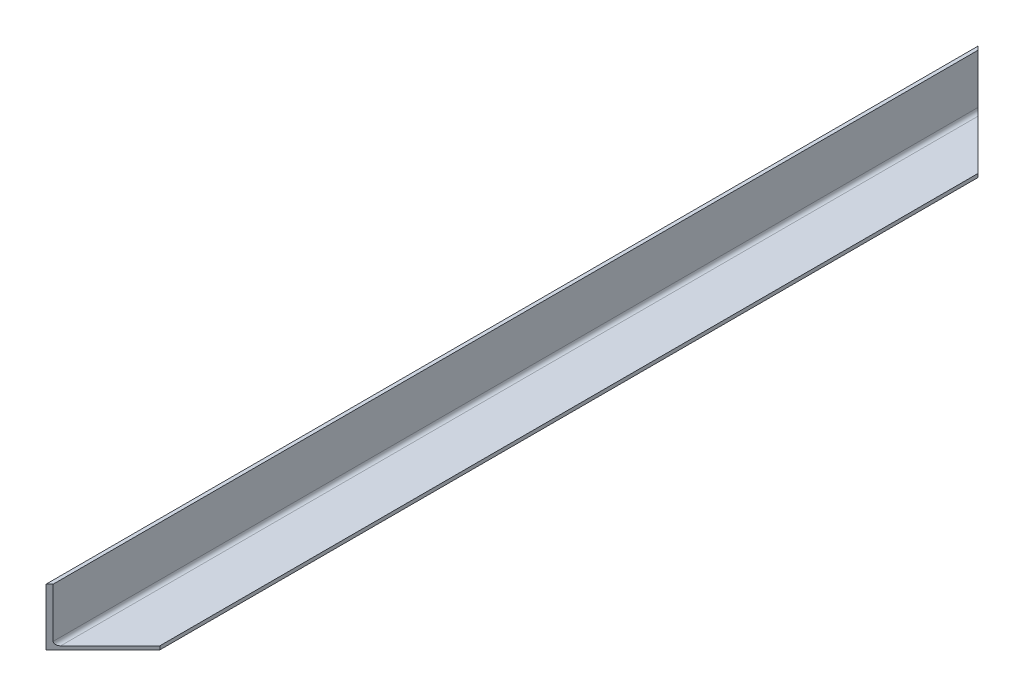
ISO-10303-21;
HEADER;
FILE_DESCRIPTION(('STEP AP214'),'2;1');
FILE_NAME('part.step','',(''),(''),'','','');
FILE_SCHEMA(('AUTOMOTIVE_DESIGN { 1 0 10303 214 1 1 1 1 }'));
ENDSEC;
DATA;
#1=APPLICATION_CONTEXT('core data for automotive mechanical design processes');
#2=APPLICATION_PROTOCOL_DEFINITION('international standard','automotive_design',2000,#1);
#3=PRODUCT_CONTEXT('',#1,'mechanical');
#4=PRODUCT('Part','Part','',(#3));
#5=PRODUCT_RELATED_PRODUCT_CATEGORY('part','',(#4));
#6=PRODUCT_DEFINITION_FORMATION('','',#4);
#7=PRODUCT_DEFINITION_CONTEXT('part definition',#1,'design');
#8=PRODUCT_DEFINITION('design','',#6,#7);
#9=PRODUCT_DEFINITION_SHAPE('','',#8);
#10=(LENGTH_UNIT() NAMED_UNIT(*) SI_UNIT(.MILLI.,.METRE.));
#11=(NAMED_UNIT(*) PLANE_ANGLE_UNIT() SI_UNIT($,.RADIAN.));
#12=(NAMED_UNIT(*) SI_UNIT($,.STERADIAN.) SOLID_ANGLE_UNIT());
#13=UNCERTAINTY_MEASURE_WITH_UNIT(LENGTH_MEASURE(1.E-05),#10,'distance_accuracy_value','');
#14=(GEOMETRIC_REPRESENTATION_CONTEXT(3) GLOBAL_UNCERTAINTY_ASSIGNED_CONTEXT((#13)) GLOBAL_UNIT_ASSIGNED_CONTEXT((#10,
#11,#12)) REPRESENTATION_CONTEXT('',''));
#15=CARTESIAN_POINT('',(0.,0.,0.));
#16=DIRECTION('',(0.,0.,1.));
#17=DIRECTION('',(1.,0.,0.));
#18=AXIS2_PLACEMENT_3D('',#15,#16,#17);
#19=CARTESIAN_POINT('',(-22.225,25.4,-415.925));
#20=DIRECTION('',(0.,1.,0.));
#21=DIRECTION('',(-1.,0.,0.));
#22=AXIS2_PLACEMENT_3D('',#19,#20,#21);
#23=PLANE('',#22);
#24=DIRECTION('',(0.707106781186547,0.,0.707106781186548));
#25=VECTOR('',#24,1.);
#26=CARTESIAN_POINT('',(-25.4,25.4,-415.925));
#27=LINE('',#26,#25);
#28=CARTESIAN_POINT('',(-25.4,25.4,-415.925));
#29=VERTEX_POINT('',#28);
#30=CARTESIAN_POINT('',(-22.225,25.4,-412.75));
#31=VERTEX_POINT('',#30);
#32=EDGE_CURVE('E112',#29,#31,#27,.T.);
#33=ORIENTED_EDGE('',*,*,#32,.F.);
#34=DIRECTION('',(0.,0.,1.));
#35=VECTOR('',#34,1.);
#36=CARTESIAN_POINT('',(-25.4,25.4,-415.925));
#37=LINE('',#36,#35);
#38=CARTESIAN_POINT('',(-25.4,25.4,415.925));
#39=VERTEX_POINT('',#38);
#40=EDGE_CURVE('E48',#29,#39,#37,.T.);
#41=ORIENTED_EDGE('',*,*,#40,.T.);
#42=DIRECTION('',(-0.707106781186547,0.,0.707106781186548));
#43=VECTOR('',#42,1.);
#44=CARTESIAN_POINT('',(-25.4,25.4,415.925));
#45=LINE('',#44,#43);
#46=CARTESIAN_POINT('',(-22.225,25.4,412.75));
#47=VERTEX_POINT('',#46);
#48=EDGE_CURVE('E72',#47,#39,#45,.T.);
#49=ORIENTED_EDGE('',*,*,#48,.F.);
#50=DIRECTION('',(0.,0.,1.));
#51=VECTOR('',#50,1.);
#52=CARTESIAN_POINT('',(-22.225,25.4,-415.925));
#53=LINE('',#52,#51);
#54=EDGE_CURVE('E11',#31,#47,#53,.T.);
#55=ORIENTED_EDGE('',*,*,#54,.F.);
#56=EDGE_LOOP('',(#33,#41,#49,#55));
#57=FACE_BOUND('',#56,.T.);
#58=ADVANCED_FACE('F45',(#57),#23,.T.);
#59=CARTESIAN_POINT('',(-22.225,-18.8383333333333,-415.925));
#60=DIRECTION('',(1.,0.,0.));
#61=DIRECTION('',(0.,1.,0.));
#62=AXIS2_PLACEMENT_3D('',#59,#60,#61);
#63=PLANE('',#62);
#64=DIRECTION('',(0.,-1.,0.));
#65=VECTOR('',#64,1.);
#66=CARTESIAN_POINT('',(-22.225,-18.8383333333333,-412.75));
#67=LINE('',#66,#65);
#68=CARTESIAN_POINT('',(-22.225,-18.8383333333333,-412.75));
#69=VERTEX_POINT('',#68);
#70=EDGE_CURVE('E148',#31,#69,#67,.T.);
#71=ORIENTED_EDGE('',*,*,#70,.F.);
#72=ORIENTED_EDGE('',*,*,#54,.T.);
#73=DIRECTION('',(0.,1.,0.));
#74=VECTOR('',#73,1.);
#75=CARTESIAN_POINT('',(-22.225,-18.8383333333335,412.75));
#76=LINE('',#75,#74);
#77=CARTESIAN_POINT('',(-22.225,-18.8383333333333,412.75));
#78=VERTEX_POINT('',#77);
#79=EDGE_CURVE('E156',#78,#47,#76,.T.);
#80=ORIENTED_EDGE('',*,*,#79,.F.);
#81=DIRECTION('',(0.,0.,1.));
#82=VECTOR('',#81,1.);
#83=CARTESIAN_POINT('',(-22.225,-18.8383333333333,-415.925));
#84=LINE('',#83,#82);
#85=EDGE_CURVE('E54',#69,#78,#84,.T.);
#86=ORIENTED_EDGE('',*,*,#85,.F.);
#87=EDGE_LOOP('',(#71,#72,#80,#86));
#88=FACE_BOUND('',#87,.T.);
#89=ADVANCED_FACE('F199',(#88),#63,.T.);
#90=CARTESIAN_POINT('',(-18.8383333333333,-18.8383333333333,-415.925));
#91=DIRECTION('',(0.,0.,1.));
#92=DIRECTION('',(1.,0.,0.));
#93=AXIS2_PLACEMENT_3D('',#90,#91,#92);
#94=CYLINDRICAL_SURFACE('',#93,3.38666666666666);
#95=CARTESIAN_POINT('',(-18.8383333333333,-18.8383333333333,-409.363333333333));
#96=DIRECTION('',(-0.707106781186548,0.,0.707106781186547));
#97=DIRECTION('',(0.707106781186547,0.,0.707106781186548));
#98=AXIS2_PLACEMENT_3D('',#95,#96,#97);
#99=ELLIPSE('',#98,4.78946993123688,3.38666666666666);
#100=CARTESIAN_POINT('',(-18.8383333333333,-22.225,-409.363333333333));
#101=VERTEX_POINT('',#100);
#102=EDGE_CURVE('E151',#69,#101,#99,.T.);
#103=ORIENTED_EDGE('',*,*,#102,.F.);
#104=ORIENTED_EDGE('',*,*,#85,.T.);
#105=CARTESIAN_POINT('',(-18.8383333333333,-18.8383333333333,409.363333333333));
#106=DIRECTION('',(-0.707106781186548,0.,-0.707106781186547));
#107=DIRECTION('',(-0.707106781186547,0.,0.707106781186548));
#108=AXIS2_PLACEMENT_3D('',#105,#106,#107);
#109=ELLIPSE('',#108,4.78946993123688,3.38666666666666);
#110=CARTESIAN_POINT('',(-18.8383333333333,-22.225,409.363333333333));
#111=VERTEX_POINT('',#110);
#112=EDGE_CURVE('E159',#111,#78,#109,.T.);
#113=ORIENTED_EDGE('',*,*,#112,.F.);
#114=DIRECTION('',(0.,0.,1.));
#115=VECTOR('',#114,1.);
#116=CARTESIAN_POINT('',(-18.8383333333333,-22.225,-415.925));
#117=LINE('',#116,#115);
#118=EDGE_CURVE('E140',#101,#111,#117,.T.);
#119=ORIENTED_EDGE('',*,*,#118,.F.);
#120=EDGE_LOOP('',(#103,#104,#113,#119));
#121=FACE_BOUND('',#120,.T.);
#122=ADVANCED_FACE('F195',(#121),#94,.F.);
#123=CARTESIAN_POINT('',(25.4,-22.225,-415.925));
#124=DIRECTION('',(0.,1.,0.));
#125=DIRECTION('',(-1.,0.,0.));
#126=AXIS2_PLACEMENT_3D('',#123,#124,#125);
#127=PLANE('',#126);
#128=DIRECTION('',(0.707106781186547,0.,0.707106781186548));
#129=VECTOR('',#128,1.);
#130=CARTESIAN_POINT('',(0.,-22.225,-390.525));
#131=LINE('',#130,#129);
#132=CARTESIAN_POINT('',(25.4,-22.225,-365.125));
#133=VERTEX_POINT('',#132);
#134=EDGE_CURVE('E154',#101,#133,#131,.T.);
#135=ORIENTED_EDGE('',*,*,#134,.F.);
#136=ORIENTED_EDGE('',*,*,#118,.T.);
#137=DIRECTION('',(-0.707106781186547,0.,0.707106781186548));
#138=VECTOR('',#137,1.);
#139=CARTESIAN_POINT('',(415.925,-22.225,-25.4000000000001));
#140=LINE('',#139,#138);
#141=CARTESIAN_POINT('',(25.4,-22.225,365.125));
#142=VERTEX_POINT('',#141);
#143=EDGE_CURVE('E162',#142,#111,#140,.T.);
#144=ORIENTED_EDGE('',*,*,#143,.F.);
#145=DIRECTION('',(0.,0.,1.));
#146=VECTOR('',#145,1.);
#147=CARTESIAN_POINT('',(25.4,-22.225,-415.925));
#148=LINE('',#147,#146);
#149=EDGE_CURVE('E134',#133,#142,#148,.T.);
#150=ORIENTED_EDGE('',*,*,#149,.F.);
#151=EDGE_LOOP('',(#135,#136,#144,#150));
#152=FACE_BOUND('',#151,.T.);
#153=ADVANCED_FACE('F191',(#152),#127,.T.);
#154=CARTESIAN_POINT('',(25.4,-25.4,-415.925));
#155=DIRECTION('',(1.,0.,0.));
#156=DIRECTION('',(0.,1.,0.));
#157=AXIS2_PLACEMENT_3D('',#154,#155,#156);
#158=PLANE('',#157);
#159=DIRECTION('',(0.,1.,0.));
#160=VECTOR('',#159,1.);
#161=CARTESIAN_POINT('',(25.4,-25.4,-365.125));
#162=LINE('',#161,#160);
#163=CARTESIAN_POINT('',(25.4,-25.4,-365.125));
#164=VERTEX_POINT('',#163);
#165=EDGE_CURVE('E165',#164,#133,#162,.T.);
#166=ORIENTED_EDGE('',*,*,#165,.T.);
#167=ORIENTED_EDGE('',*,*,#149,.T.);
#168=DIRECTION('',(0.,1.,0.));
#169=VECTOR('',#168,1.);
#170=CARTESIAN_POINT('',(25.4,-25.4,365.125));
#171=LINE('',#170,#169);
#172=CARTESIAN_POINT('',(25.4,-25.4,365.125));
#173=VERTEX_POINT('',#172);
#174=EDGE_CURVE('E172',#173,#142,#171,.T.);
#175=ORIENTED_EDGE('',*,*,#174,.F.);
#176=DIRECTION('',(0.,0.,1.));
#177=VECTOR('',#176,1.);
#178=CARTESIAN_POINT('',(25.4,-25.4,-415.925));
#179=LINE('',#178,#177);
#180=EDGE_CURVE('E130',#164,#173,#179,.T.);
#181=ORIENTED_EDGE('',*,*,#180,.F.);
#182=EDGE_LOOP('',(#166,#167,#175,#181));
#183=FACE_BOUND('',#182,.T.);
#184=ADVANCED_FACE('F184',(#183),#158,.T.);
#185=CARTESIAN_POINT('',(-25.4,-25.4,-415.925));
#186=DIRECTION('',(0.,-1.,0.));
#187=DIRECTION('',(1.,0.,0.));
#188=AXIS2_PLACEMENT_3D('',#185,#186,#187);
#189=PLANE('',#188);
#190=DIRECTION('',(0.707106781186547,0.,0.707106781186548));
#191=VECTOR('',#190,1.);
#192=CARTESIAN_POINT('',(-25.4,-25.4,-415.925));
#193=LINE('',#192,#191);
#194=CARTESIAN_POINT('',(-25.4,-25.4,-415.925));
#195=VERTEX_POINT('',#194);
#196=EDGE_CURVE('E64',#195,#164,#193,.T.);
#197=ORIENTED_EDGE('',*,*,#196,.T.);
#198=ORIENTED_EDGE('',*,*,#180,.T.);
#199=DIRECTION('',(-0.707106781186547,0.,0.707106781186548));
#200=VECTOR('',#199,1.);
#201=CARTESIAN_POINT('',(-25.4,-25.4,415.925));
#202=LINE('',#201,#200);
#203=CARTESIAN_POINT('',(-25.4,-25.4,415.925));
#204=VERTEX_POINT('',#203);
#205=EDGE_CURVE('E168',#173,#204,#202,.T.);
#206=ORIENTED_EDGE('',*,*,#205,.T.);
#207=DIRECTION('',(0.,0.,1.));
#208=VECTOR('',#207,1.);
#209=CARTESIAN_POINT('',(-25.4,-25.4,-415.925));
#210=LINE('',#209,#208);
#211=EDGE_CURVE('E127',#195,#204,#210,.T.);
#212=ORIENTED_EDGE('',*,*,#211,.F.);
#213=EDGE_LOOP('',(#197,#198,#206,#212));
#214=FACE_BOUND('',#213,.T.);
#215=ADVANCED_FACE('F181',(#214),#189,.T.);
#216=CARTESIAN_POINT('',(-25.4,25.4,-415.925));
#217=DIRECTION('',(-1.,0.,0.));
#218=DIRECTION('',(0.,-1.,0.));
#219=AXIS2_PLACEMENT_3D('',#216,#217,#218);
#220=PLANE('',#219);
#221=ORIENTED_EDGE('',*,*,#211,.T.);
#222=DIRECTION('',(0.,-1.,0.));
#223=VECTOR('',#222,1.);
#224=CARTESIAN_POINT('',(-25.4,25.4,415.925));
#225=LINE('',#224,#223);
#226=EDGE_CURVE('E118',#39,#204,#225,.T.);
#227=ORIENTED_EDGE('',*,*,#226,.F.);
#228=ORIENTED_EDGE('',*,*,#40,.F.);
#229=DIRECTION('',(0.,-1.,0.));
#230=VECTOR('',#229,1.);
#231=CARTESIAN_POINT('',(-25.4,25.4,-415.925));
#232=LINE('',#231,#230);
#233=EDGE_CURVE('E109',#29,#195,#232,.T.);
#234=ORIENTED_EDGE('',*,*,#233,.T.);
#235=EDGE_LOOP('',(#221,#227,#228,#234));
#236=FACE_BOUND('',#235,.T.);
#237=ADVANCED_FACE('F125',(#236),#220,.T.);
#238=CARTESIAN_POINT('',(-25.4,-25.4,415.925));
#239=DIRECTION('',(-0.707106781186548,0.,-0.707106781186547));
#240=DIRECTION('',(-0.707106781186547,0.,0.707106781186548));
#241=AXIS2_PLACEMENT_3D('',#238,#239,#240);
#242=PLANE('',#241);
#243=ORIENTED_EDGE('',*,*,#79,.T.);
#244=ORIENTED_EDGE('',*,*,#48,.T.);
#245=ORIENTED_EDGE('',*,*,#226,.T.);
#246=ORIENTED_EDGE('',*,*,#205,.F.);
#247=ORIENTED_EDGE('',*,*,#174,.T.);
#248=ORIENTED_EDGE('',*,*,#143,.T.);
#249=ORIENTED_EDGE('',*,*,#112,.T.);
#250=EDGE_LOOP('',(#243,#244,#245,#246,#247,#248,#249));
#251=FACE_BOUND('',#250,.T.);
#252=ADVANCED_FACE('F187',(#251),#242,.F.);
#253=CARTESIAN_POINT('',(-25.4,-25.4,-415.925));
#254=DIRECTION('',(-0.707106781186548,0.,0.707106781186547));
#255=DIRECTION('',(0.707106781186547,0.,0.707106781186548));
#256=AXIS2_PLACEMENT_3D('',#253,#254,#255);
#257=PLANE('',#256);
#258=ORIENTED_EDGE('',*,*,#70,.T.);
#259=ORIENTED_EDGE('',*,*,#102,.T.);
#260=ORIENTED_EDGE('',*,*,#134,.T.);
#261=ORIENTED_EDGE('',*,*,#165,.F.);
#262=ORIENTED_EDGE('',*,*,#196,.F.);
#263=ORIENTED_EDGE('',*,*,#233,.F.);
#264=ORIENTED_EDGE('',*,*,#32,.T.);
#265=EDGE_LOOP('',(#258,#259,#260,#261,#262,#263,#264));
#266=FACE_BOUND('',#265,.T.);
#267=ADVANCED_FACE('F111',(#266),#257,.F.);
#268=CLOSED_SHELL('',(#58,#89,#122,#153,#184,#215,#237,#252,#267));
#269=MANIFOLD_SOLID_BREP('B2',#268);
#270=ADVANCED_BREP_SHAPE_REPRESENTATION('',(#18,#269),#14);
#271=SHAPE_DEFINITION_REPRESENTATION(#9,#270);
ENDSEC;
END-ISO-10303-21;
